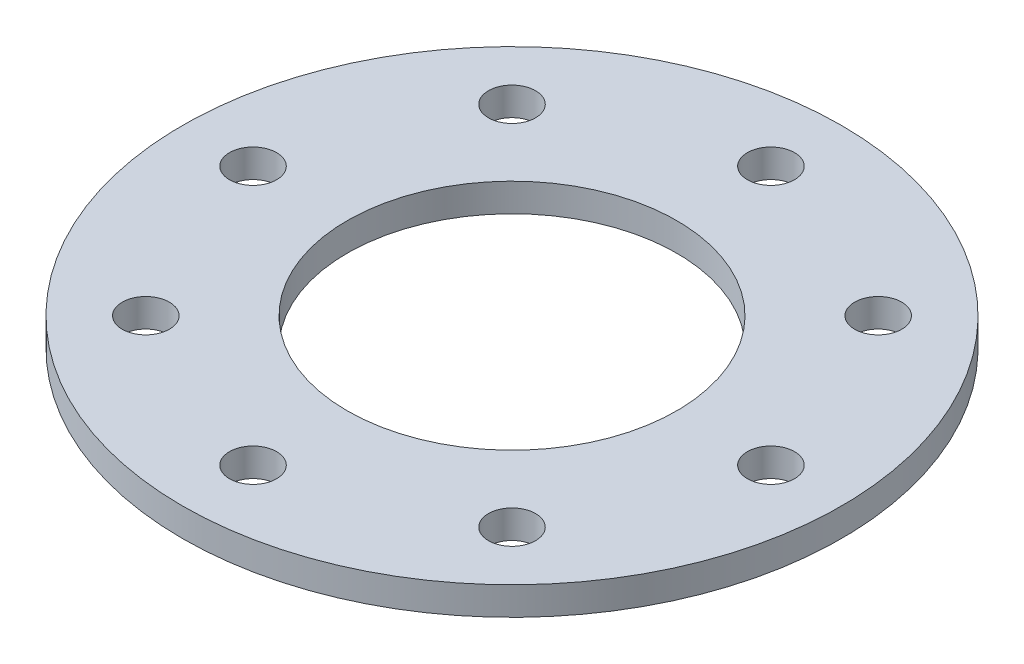
ISO-10303-21;
HEADER;
FILE_DESCRIPTION(('STEP AP214'),'2;1');
FILE_NAME('part.step','',(''),(''),'','','');
FILE_SCHEMA(('AUTOMOTIVE_DESIGN { 1 0 10303 214 1 1 1 1 }'));
ENDSEC;
DATA;
#1=APPLICATION_CONTEXT('core data for automotive mechanical design processes');
#2=APPLICATION_PROTOCOL_DEFINITION('international standard','automotive_design',2000,#1);
#3=PRODUCT_CONTEXT('',#1,'mechanical');
#4=PRODUCT('Part','Part','',(#3));
#5=PRODUCT_RELATED_PRODUCT_CATEGORY('part','',(#4));
#6=PRODUCT_DEFINITION_FORMATION('','',#4);
#7=PRODUCT_DEFINITION_CONTEXT('part definition',#1,'design');
#8=PRODUCT_DEFINITION('design','',#6,#7);
#9=PRODUCT_DEFINITION_SHAPE('','',#8);
#10=(LENGTH_UNIT() NAMED_UNIT(*) SI_UNIT(.MILLI.,.METRE.));
#11=(NAMED_UNIT(*) PLANE_ANGLE_UNIT() SI_UNIT($,.RADIAN.));
#12=(NAMED_UNIT(*) SI_UNIT($,.STERADIAN.) SOLID_ANGLE_UNIT());
#13=UNCERTAINTY_MEASURE_WITH_UNIT(LENGTH_MEASURE(1.E-05),#10,'distance_accuracy_value','');
#14=(GEOMETRIC_REPRESENTATION_CONTEXT(3) GLOBAL_UNCERTAINTY_ASSIGNED_CONTEXT((#13)) GLOBAL_UNIT_ASSIGNED_CONTEXT((#10,
#11,#12)) REPRESENTATION_CONTEXT('',''));
#15=CARTESIAN_POINT('',(0.,0.,0.));
#16=DIRECTION('',(0.,0.,1.));
#17=DIRECTION('',(1.,0.,0.));
#18=AXIS2_PLACEMENT_3D('',#15,#16,#17);
#19=CARTESIAN_POINT('',(0.,0.6,0.));
#20=DIRECTION('',(0.,1.,0.));
#21=DIRECTION('',(0.,0.,1.));
#22=AXIS2_PLACEMENT_3D('',#19,#20,#21);
#23=PLANE('',#22);
#24=CARTESIAN_POINT('',(7.77817459305193,0.6,-7.77817459305212));
#25=DIRECTION('',(0.,1.,0.));
#26=DIRECTION('',(0.,0.,1.));
#27=AXIS2_PLACEMENT_3D('',#24,#25,#26);
#28=CIRCLE('',#27,0.999999999999999);
#29=CARTESIAN_POINT('',(7.77817459305193,0.6,-6.77817459305212));
#30=VERTEX_POINT('',#29);
#31=EDGE_CURVE('E94',#30,#30,#28,.T.);
#32=ORIENTED_EDGE('',*,*,#31,.F.);
#33=EDGE_LOOP('',(#32));
#34=FACE_BOUND('',#33,.T.);
#35=CARTESIAN_POINT('',(11.,0.6,-1.15218884181823E-13));
#36=DIRECTION('',(0.,1.,0.));
#37=DIRECTION('',(0.,0.,1.));
#38=AXIS2_PLACEMENT_3D('',#35,#36,#37);
#39=CIRCLE('',#38,1.);
#40=CARTESIAN_POINT('',(11.,0.6,0.999999999999886));
#41=VERTEX_POINT('',#40);
#42=EDGE_CURVE('E88',#41,#41,#39,.T.);
#43=ORIENTED_EDGE('',*,*,#42,.F.);
#44=EDGE_LOOP('',(#43));
#45=FACE_BOUND('',#44,.T.);
#46=CARTESIAN_POINT('',(7.77817459305209,0.6,7.77817459305195));
#47=DIRECTION('',(0.,1.,0.));
#48=DIRECTION('',(0.,0.,1.));
#49=AXIS2_PLACEMENT_3D('',#46,#47,#48);
#50=CIRCLE('',#49,1.);
#51=CARTESIAN_POINT('',(7.77817459305209,0.6,8.77817459305195));
#52=VERTEX_POINT('',#51);
#53=EDGE_CURVE('E82',#52,#52,#50,.T.);
#54=ORIENTED_EDGE('',*,*,#53,.F.);
#55=EDGE_LOOP('',(#54));
#56=FACE_BOUND('',#55,.T.);
#57=CARTESIAN_POINT('',(0.,0.6,11.));
#58=DIRECTION('',(0.,1.,0.));
#59=DIRECTION('',(0.,0.,1.));
#60=AXIS2_PLACEMENT_3D('',#57,#58,#59);
#61=CIRCLE('',#60,1.);
#62=CARTESIAN_POINT('',(0.,0.6,12.));
#63=VERTEX_POINT('',#62);
#64=EDGE_CURVE('E76',#63,#63,#61,.T.);
#65=ORIENTED_EDGE('',*,*,#64,.F.);
#66=EDGE_LOOP('',(#65));
#67=FACE_BOUND('',#66,.T.);
#68=CARTESIAN_POINT('',(-7.77817459305198,0.6,7.77817459305206));
#69=DIRECTION('',(0.,1.,0.));
#70=DIRECTION('',(0.,0.,1.));
#71=AXIS2_PLACEMENT_3D('',#68,#69,#70);
#72=CIRCLE('',#71,1.);
#73=CARTESIAN_POINT('',(-7.77817459305198,0.6,8.77817459305206));
#74=VERTEX_POINT('',#73);
#75=EDGE_CURVE('E70',#74,#74,#72,.T.);
#76=ORIENTED_EDGE('',*,*,#75,.F.);
#77=EDGE_LOOP('',(#76));
#78=FACE_BOUND('',#77,.T.);
#79=CARTESIAN_POINT('',(-11.,0.6,0.));
#80=DIRECTION('',(0.,1.,0.));
#81=DIRECTION('',(0.,0.,1.));
#82=AXIS2_PLACEMENT_3D('',#79,#80,#81);
#83=CIRCLE('',#82,1.);
#84=CARTESIAN_POINT('',(-11.,0.6,1.00000000000004));
#85=VERTEX_POINT('',#84);
#86=EDGE_CURVE('E64',#85,#85,#83,.T.);
#87=ORIENTED_EDGE('',*,*,#86,.F.);
#88=EDGE_LOOP('',(#87));
#89=FACE_BOUND('',#88,.T.);
#90=CARTESIAN_POINT('',(-7.77817459305204,0.6,-7.77817459305201));
#91=DIRECTION('',(0.,1.,0.));
#92=DIRECTION('',(0.,0.,1.));
#93=AXIS2_PLACEMENT_3D('',#90,#91,#92);
#94=CIRCLE('',#93,1.);
#95=CARTESIAN_POINT('',(-7.77817459305204,0.6,-6.77817459305201));
#96=VERTEX_POINT('',#95);
#97=EDGE_CURVE('E58',#96,#96,#94,.T.);
#98=ORIENTED_EDGE('',*,*,#97,.F.);
#99=EDGE_LOOP('',(#98));
#100=FACE_BOUND('',#99,.T.);
#101=CARTESIAN_POINT('',(0.,0.6,-11.));
#102=DIRECTION('',(0.,1.,0.));
#103=DIRECTION('',(0.,0.,1.));
#104=AXIS2_PLACEMENT_3D('',#101,#102,#103);
#105=CIRCLE('',#104,1.);
#106=CARTESIAN_POINT('',(0.,0.6,-10.));
#107=VERTEX_POINT('',#106);
#108=EDGE_CURVE('E52',#107,#107,#105,.T.);
#109=ORIENTED_EDGE('',*,*,#108,.F.);
#110=EDGE_LOOP('',(#109));
#111=FACE_BOUND('',#110,.T.);
#112=CARTESIAN_POINT('',(0.,0.6,0.));
#113=DIRECTION('',(0.,1.,0.));
#114=DIRECTION('',(0.,0.,1.));
#115=AXIS2_PLACEMENT_3D('',#112,#113,#114);
#116=CIRCLE('',#115,14.);
#117=CARTESIAN_POINT('',(0.,0.6,14.));
#118=VERTEX_POINT('',#117);
#119=EDGE_CURVE('E10',#118,#118,#116,.T.);
#120=ORIENTED_EDGE('',*,*,#119,.T.);
#121=EDGE_LOOP('',(#120));
#122=FACE_BOUND('',#121,.T.);
#123=CARTESIAN_POINT('',(0.,0.6,0.));
#124=DIRECTION('',(0.,1.,0.));
#125=DIRECTION('',(0.,0.,1.));
#126=AXIS2_PLACEMENT_3D('',#123,#124,#125);
#127=CIRCLE('',#126,7.);
#128=CARTESIAN_POINT('',(0.,0.6,7.));
#129=VERTEX_POINT('',#128);
#130=EDGE_CURVE('E42',#129,#129,#127,.T.);
#131=ORIENTED_EDGE('',*,*,#130,.F.);
#132=EDGE_LOOP('',(#131));
#133=FACE_BOUND('',#132,.T.);
#134=ADVANCED_FACE('F31',(#34,#45,#56,#67,#78,#89,#100,#111,#122,#133),#23,.T.);
#135=CARTESIAN_POINT('',(0.,-0.6,0.));
#136=DIRECTION('',(0.,1.,0.));
#137=DIRECTION('',(0.,0.,1.));
#138=AXIS2_PLACEMENT_3D('',#135,#136,#137);
#139=PLANE('',#138);
#140=CARTESIAN_POINT('',(7.77817459305193,-0.6,-7.77817459305212));
#141=DIRECTION('',(0.,1.,0.));
#142=DIRECTION('',(0.,0.,1.));
#143=AXIS2_PLACEMENT_3D('',#140,#141,#142);
#144=CIRCLE('',#143,0.999999999999999);
#145=CARTESIAN_POINT('',(7.77817459305193,-0.6,-6.77817459305212));
#146=VERTEX_POINT('',#145);
#147=EDGE_CURVE('E91',#146,#146,#144,.T.);
#148=ORIENTED_EDGE('',*,*,#147,.T.);
#149=EDGE_LOOP('',(#148));
#150=FACE_BOUND('',#149,.T.);
#151=CARTESIAN_POINT('',(11.,-0.6,-1.15218884181823E-13));
#152=DIRECTION('',(0.,1.,0.));
#153=DIRECTION('',(0.,0.,1.));
#154=AXIS2_PLACEMENT_3D('',#151,#152,#153);
#155=CIRCLE('',#154,0.999999999999999);
#156=CARTESIAN_POINT('',(11.,-0.6,0.999999999999884));
#157=VERTEX_POINT('',#156);
#158=EDGE_CURVE('E85',#157,#157,#155,.T.);
#159=ORIENTED_EDGE('',*,*,#158,.T.);
#160=EDGE_LOOP('',(#159));
#161=FACE_BOUND('',#160,.T.);
#162=CARTESIAN_POINT('',(7.77817459305209,-0.6,7.77817459305195));
#163=DIRECTION('',(0.,1.,0.));
#164=DIRECTION('',(0.,0.,1.));
#165=AXIS2_PLACEMENT_3D('',#162,#163,#164);
#166=CIRCLE('',#165,1.);
#167=CARTESIAN_POINT('',(7.77817459305209,-0.6,8.77817459305195));
#168=VERTEX_POINT('',#167);
#169=EDGE_CURVE('E79',#168,#168,#166,.T.);
#170=ORIENTED_EDGE('',*,*,#169,.T.);
#171=EDGE_LOOP('',(#170));
#172=FACE_BOUND('',#171,.T.);
#173=CARTESIAN_POINT('',(0.,-0.6,11.));
#174=DIRECTION('',(0.,1.,0.));
#175=DIRECTION('',(0.,0.,1.));
#176=AXIS2_PLACEMENT_3D('',#173,#174,#175);
#177=CIRCLE('',#176,1.);
#178=CARTESIAN_POINT('',(0.,-0.6,12.));
#179=VERTEX_POINT('',#178);
#180=EDGE_CURVE('E73',#179,#179,#177,.T.);
#181=ORIENTED_EDGE('',*,*,#180,.T.);
#182=EDGE_LOOP('',(#181));
#183=FACE_BOUND('',#182,.T.);
#184=CARTESIAN_POINT('',(-7.77817459305198,-0.6,7.77817459305206));
#185=DIRECTION('',(0.,1.,0.));
#186=DIRECTION('',(0.,0.,1.));
#187=AXIS2_PLACEMENT_3D('',#184,#185,#186);
#188=CIRCLE('',#187,1.);
#189=CARTESIAN_POINT('',(-7.77817459305198,-0.6,8.77817459305206));
#190=VERTEX_POINT('',#189);
#191=EDGE_CURVE('E67',#190,#190,#188,.T.);
#192=ORIENTED_EDGE('',*,*,#191,.T.);
#193=EDGE_LOOP('',(#192));
#194=FACE_BOUND('',#193,.T.);
#195=CARTESIAN_POINT('',(-11.,-0.6,0.));
#196=DIRECTION('',(0.,1.,0.));
#197=DIRECTION('',(0.,0.,1.));
#198=AXIS2_PLACEMENT_3D('',#195,#196,#197);
#199=CIRCLE('',#198,0.999999999999999);
#200=CARTESIAN_POINT('',(-11.,-0.6,1.00000000000004));
#201=VERTEX_POINT('',#200);
#202=EDGE_CURVE('E61',#201,#201,#199,.T.);
#203=ORIENTED_EDGE('',*,*,#202,.T.);
#204=EDGE_LOOP('',(#203));
#205=FACE_BOUND('',#204,.T.);
#206=CARTESIAN_POINT('',(-7.77817459305204,-0.6,-7.77817459305201));
#207=DIRECTION('',(0.,1.,0.));
#208=DIRECTION('',(0.,0.,1.));
#209=AXIS2_PLACEMENT_3D('',#206,#207,#208);
#210=CIRCLE('',#209,1.);
#211=CARTESIAN_POINT('',(-7.77817459305204,-0.6,-6.77817459305201));
#212=VERTEX_POINT('',#211);
#213=EDGE_CURVE('E55',#212,#212,#210,.T.);
#214=ORIENTED_EDGE('',*,*,#213,.T.);
#215=EDGE_LOOP('',(#214));
#216=FACE_BOUND('',#215,.T.);
#217=CARTESIAN_POINT('',(0.,-0.6,-11.));
#218=DIRECTION('',(0.,1.,0.));
#219=DIRECTION('',(0.,0.,1.));
#220=AXIS2_PLACEMENT_3D('',#217,#218,#219);
#221=CIRCLE('',#220,1.);
#222=CARTESIAN_POINT('',(0.,-0.6,-10.));
#223=VERTEX_POINT('',#222);
#224=EDGE_CURVE('E47',#223,#223,#221,.T.);
#225=ORIENTED_EDGE('',*,*,#224,.T.);
#226=EDGE_LOOP('',(#225));
#227=FACE_BOUND('',#226,.T.);
#228=CARTESIAN_POINT('',(0.,-0.6,0.));
#229=DIRECTION('',(0.,1.,0.));
#230=DIRECTION('',(0.,0.,1.));
#231=AXIS2_PLACEMENT_3D('',#228,#229,#230);
#232=CIRCLE('',#231,14.);
#233=CARTESIAN_POINT('',(0.,-0.6,14.));
#234=VERTEX_POINT('',#233);
#235=EDGE_CURVE('E35',#234,#234,#232,.T.);
#236=ORIENTED_EDGE('',*,*,#235,.F.);
#237=EDGE_LOOP('',(#236));
#238=FACE_BOUND('',#237,.T.);
#239=CARTESIAN_POINT('',(0.,-0.6,0.));
#240=DIRECTION('',(0.,1.,0.));
#241=DIRECTION('',(0.,0.,1.));
#242=AXIS2_PLACEMENT_3D('',#239,#240,#241);
#243=CIRCLE('',#242,7.);
#244=CARTESIAN_POINT('',(0.,-0.6,7.));
#245=VERTEX_POINT('',#244);
#246=EDGE_CURVE('E44',#245,#245,#243,.T.);
#247=ORIENTED_EDGE('',*,*,#246,.T.);
#248=EDGE_LOOP('',(#247));
#249=FACE_BOUND('',#248,.T.);
#250=ADVANCED_FACE('F102',(#150,#161,#172,#183,#194,#205,#216,#227,#238,#249),#139,.F.);
#251=CARTESIAN_POINT('',(0.,0.6,0.));
#252=DIRECTION('',(0.,-1.,0.));
#253=DIRECTION('',(0.,0.,-1.));
#254=AXIS2_PLACEMENT_3D('',#251,#252,#253);
#255=CYLINDRICAL_SURFACE('',#254,14.);
#256=ORIENTED_EDGE('',*,*,#119,.F.);
#257=EDGE_LOOP('',(#256));
#258=FACE_BOUND('',#257,.T.);
#259=ORIENTED_EDGE('',*,*,#235,.T.);
#260=EDGE_LOOP('',(#259));
#261=FACE_BOUND('',#260,.T.);
#262=ADVANCED_FACE('F33',(#258,#261),#255,.T.);
#263=CARTESIAN_POINT('',(0.,0.6,0.));
#264=DIRECTION('',(0.,-1.,0.));
#265=DIRECTION('',(0.,0.,-1.));
#266=AXIS2_PLACEMENT_3D('',#263,#264,#265);
#267=CYLINDRICAL_SURFACE('',#266,7.);
#268=ORIENTED_EDGE('',*,*,#130,.T.);
#269=EDGE_LOOP('',(#268));
#270=FACE_BOUND('',#269,.T.);
#271=ORIENTED_EDGE('',*,*,#246,.F.);
#272=EDGE_LOOP('',(#271));
#273=FACE_BOUND('',#272,.T.);
#274=ADVANCED_FACE('F120',(#270,#273),#267,.F.);
#275=CARTESIAN_POINT('',(0.,0.6,-11.));
#276=DIRECTION('',(0.,1.,0.));
#277=DIRECTION('',(0.,0.,1.));
#278=AXIS2_PLACEMENT_3D('',#275,#276,#277);
#279=CYLINDRICAL_SURFACE('',#278,1.);
#280=ORIENTED_EDGE('',*,*,#224,.F.);
#281=EDGE_LOOP('',(#280));
#282=FACE_BOUND('',#281,.T.);
#283=ORIENTED_EDGE('',*,*,#108,.T.);
#284=EDGE_LOOP('',(#283));
#285=FACE_BOUND('',#284,.T.);
#286=ADVANCED_FACE('F123',(#282,#285),#279,.F.);
#287=CARTESIAN_POINT('',(-7.77817459305204,0.6,-7.77817459305201));
#288=DIRECTION('',(0.,1.,0.));
#289=DIRECTION('',(0.,0.,1.));
#290=AXIS2_PLACEMENT_3D('',#287,#288,#289);
#291=CYLINDRICAL_SURFACE('',#290,1.);
#292=ORIENTED_EDGE('',*,*,#213,.F.);
#293=EDGE_LOOP('',(#292));
#294=FACE_BOUND('',#293,.T.);
#295=ORIENTED_EDGE('',*,*,#97,.T.);
#296=EDGE_LOOP('',(#295));
#297=FACE_BOUND('',#296,.T.);
#298=ADVANCED_FACE('F137',(#294,#297),#291,.F.);
#299=CARTESIAN_POINT('',(-11.,0.6,0.));
#300=DIRECTION('',(0.,1.,0.));
#301=DIRECTION('',(0.,0.,1.));
#302=AXIS2_PLACEMENT_3D('',#299,#300,#301);
#303=CYLINDRICAL_SURFACE('',#302,1.);
#304=ORIENTED_EDGE('',*,*,#202,.F.);
#305=EDGE_LOOP('',(#304));
#306=FACE_BOUND('',#305,.T.);
#307=ORIENTED_EDGE('',*,*,#86,.T.);
#308=EDGE_LOOP('',(#307));
#309=FACE_BOUND('',#308,.T.);
#310=ADVANCED_FACE('F141',(#306,#309),#303,.F.);
#311=CARTESIAN_POINT('',(-7.77817459305198,0.6,7.77817459305206));
#312=DIRECTION('',(0.,1.,0.));
#313=DIRECTION('',(0.,0.,1.));
#314=AXIS2_PLACEMENT_3D('',#311,#312,#313);
#315=CYLINDRICAL_SURFACE('',#314,1.);
#316=ORIENTED_EDGE('',*,*,#191,.F.);
#317=EDGE_LOOP('',(#316));
#318=FACE_BOUND('',#317,.T.);
#319=ORIENTED_EDGE('',*,*,#75,.T.);
#320=EDGE_LOOP('',(#319));
#321=FACE_BOUND('',#320,.T.);
#322=ADVANCED_FACE('F145',(#318,#321),#315,.F.);
#323=CARTESIAN_POINT('',(0.,0.6,11.));
#324=DIRECTION('',(0.,1.,0.));
#325=DIRECTION('',(0.,0.,1.));
#326=AXIS2_PLACEMENT_3D('',#323,#324,#325);
#327=CYLINDRICAL_SURFACE('',#326,1.);
#328=ORIENTED_EDGE('',*,*,#180,.F.);
#329=EDGE_LOOP('',(#328));
#330=FACE_BOUND('',#329,.T.);
#331=ORIENTED_EDGE('',*,*,#64,.T.);
#332=EDGE_LOOP('',(#331));
#333=FACE_BOUND('',#332,.T.);
#334=ADVANCED_FACE('F149',(#330,#333),#327,.F.);
#335=CARTESIAN_POINT('',(7.77817459305209,0.6,7.77817459305195));
#336=DIRECTION('',(0.,1.,0.));
#337=DIRECTION('',(0.,0.,1.));
#338=AXIS2_PLACEMENT_3D('',#335,#336,#337);
#339=CYLINDRICAL_SURFACE('',#338,1.);
#340=ORIENTED_EDGE('',*,*,#169,.F.);
#341=EDGE_LOOP('',(#340));
#342=FACE_BOUND('',#341,.T.);
#343=ORIENTED_EDGE('',*,*,#53,.T.);
#344=EDGE_LOOP('',(#343));
#345=FACE_BOUND('',#344,.T.);
#346=ADVANCED_FACE('F153',(#342,#345),#339,.F.);
#347=CARTESIAN_POINT('',(11.,0.6,-1.15218884181823E-13));
#348=DIRECTION('',(0.,1.,0.));
#349=DIRECTION('',(0.,0.,1.));
#350=AXIS2_PLACEMENT_3D('',#347,#348,#349);
#351=CYLINDRICAL_SURFACE('',#350,1.);
#352=ORIENTED_EDGE('',*,*,#158,.F.);
#353=EDGE_LOOP('',(#352));
#354=FACE_BOUND('',#353,.T.);
#355=ORIENTED_EDGE('',*,*,#42,.T.);
#356=EDGE_LOOP('',(#355));
#357=FACE_BOUND('',#356,.T.);
#358=ADVANCED_FACE('F157',(#354,#357),#351,.F.);
#359=CARTESIAN_POINT('',(7.77817459305193,0.6,-7.77817459305212));
#360=DIRECTION('',(0.,1.,0.));
#361=DIRECTION('',(0.,0.,1.));
#362=AXIS2_PLACEMENT_3D('',#359,#360,#361);
#363=CYLINDRICAL_SURFACE('',#362,0.999999999999999);
#364=ORIENTED_EDGE('',*,*,#147,.F.);
#365=EDGE_LOOP('',(#364));
#366=FACE_BOUND('',#365,.T.);
#367=ORIENTED_EDGE('',*,*,#31,.T.);
#368=EDGE_LOOP('',(#367));
#369=FACE_BOUND('',#368,.T.);
#370=ADVANCED_FACE('F98',(#366,#369),#363,.F.);
#371=CLOSED_SHELL('',(#134,#250,#262,#274,#286,#298,#310,#322,#334,#346,#358,#370));
#372=MANIFOLD_SOLID_BREP('B2',#371);
#373=ADVANCED_BREP_SHAPE_REPRESENTATION('',(#18,#372),#14);
#374=SHAPE_DEFINITION_REPRESENTATION(#9,#373);
ENDSEC;
END-ISO-10303-21;
